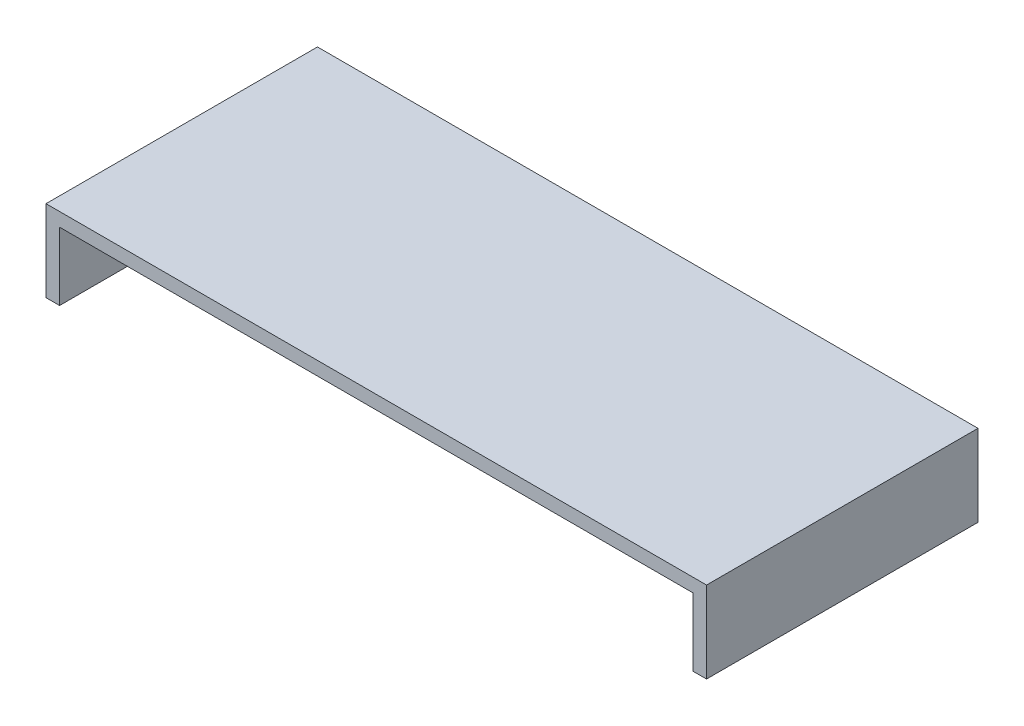
ISO-10303-21;
HEADER;
FILE_DESCRIPTION(('STEP AP214'),'2;1');
FILE_NAME('part.step','',(''),(''),'','','');
FILE_SCHEMA(('AUTOMOTIVE_DESIGN { 1 0 10303 214 1 1 1 1 }'));
ENDSEC;
DATA;
#1=APPLICATION_CONTEXT('core data for automotive mechanical design processes');
#2=APPLICATION_PROTOCOL_DEFINITION('international standard','automotive_design',2000,#1);
#3=PRODUCT_CONTEXT('',#1,'mechanical');
#4=PRODUCT('Part','Part','',(#3));
#5=PRODUCT_RELATED_PRODUCT_CATEGORY('part','',(#4));
#6=PRODUCT_DEFINITION_FORMATION('','',#4);
#7=PRODUCT_DEFINITION_CONTEXT('part definition',#1,'design');
#8=PRODUCT_DEFINITION('design','',#6,#7);
#9=PRODUCT_DEFINITION_SHAPE('','',#8);
#10=(LENGTH_UNIT() NAMED_UNIT(*) SI_UNIT(.MILLI.,.METRE.));
#11=(NAMED_UNIT(*) PLANE_ANGLE_UNIT() SI_UNIT($,.RADIAN.));
#12=(NAMED_UNIT(*) SI_UNIT($,.STERADIAN.) SOLID_ANGLE_UNIT());
#13=UNCERTAINTY_MEASURE_WITH_UNIT(LENGTH_MEASURE(1.E-05),#10,'distance_accuracy_value','');
#14=(GEOMETRIC_REPRESENTATION_CONTEXT(3) GLOBAL_UNCERTAINTY_ASSIGNED_CONTEXT((#13)) GLOBAL_UNIT_ASSIGNED_CONTEXT((#10,
#11,#12)) REPRESENTATION_CONTEXT('',''));
#15=CARTESIAN_POINT('',(0.,0.,0.));
#16=DIRECTION('',(0.,0.,1.));
#17=DIRECTION('',(1.,0.,0.));
#18=AXIS2_PLACEMENT_3D('',#15,#16,#17);
#19=CARTESIAN_POINT('',(0.,0.,0.));
#20=DIRECTION('',(0.,-1.,0.));
#21=DIRECTION('',(0.,0.,-1.));
#22=AXIS2_PLACEMENT_3D('',#19,#20,#21);
#23=PLANE('',#22);
#24=DIRECTION('',(0.,0.,-1.));
#25=VECTOR('',#24,1.);
#26=CARTESIAN_POINT('',(0.003,0.,0.));
#27=LINE('',#26,#25);
#28=CARTESIAN_POINT('',(0.003,0.,0.));
#29=VERTEX_POINT('',#28);
#30=CARTESIAN_POINT('',(0.00300000000000001,0.,-0.06));
#31=VERTEX_POINT('',#30);
#32=EDGE_CURVE('E113',#29,#31,#27,.T.);
#33=ORIENTED_EDGE('',*,*,#32,.F.);
#34=DIRECTION('',(1.,0.,0.));
#35=VECTOR('',#34,1.);
#36=CARTESIAN_POINT('',(0.,0.,0.));
#37=LINE('',#36,#35);
#38=CARTESIAN_POINT('',(0.,0.,0.));
#39=VERTEX_POINT('',#38);
#40=EDGE_CURVE('E153',#39,#29,#37,.T.);
#41=ORIENTED_EDGE('',*,*,#40,.F.);
#42=DIRECTION('',(0.,0.,1.));
#43=VECTOR('',#42,1.);
#44=CARTESIAN_POINT('',(0.,0.,0.));
#45=LINE('',#44,#43);
#46=CARTESIAN_POINT('',(0.,0.,-0.06));
#47=VERTEX_POINT('',#46);
#48=EDGE_CURVE('E137',#47,#39,#45,.T.);
#49=ORIENTED_EDGE('',*,*,#48,.F.);
#50=DIRECTION('',(-1.,0.,0.));
#51=VECTOR('',#50,1.);
#52=CARTESIAN_POINT('',(0.,0.,-0.06));
#53=LINE('',#52,#51);
#54=EDGE_CURVE('E80',#31,#47,#53,.T.);
#55=ORIENTED_EDGE('',*,*,#54,.F.);
#56=EDGE_LOOP('',(#33,#41,#49,#55));
#57=FACE_BOUND('',#56,.T.);
#58=ADVANCED_FACE('F35',(#57),#23,.T.);
#59=CARTESIAN_POINT('',(0.,0.018,0.));
#60=DIRECTION('',(1.,0.,0.));
#61=DIRECTION('',(0.,0.,-1.));
#62=AXIS2_PLACEMENT_3D('',#59,#60,#61);
#63=PLANE('',#62);
#64=ORIENTED_EDGE('',*,*,#48,.T.);
#65=DIRECTION('',(0.,-1.,0.));
#66=VECTOR('',#65,1.);
#67=CARTESIAN_POINT('',(0.,0.018,0.));
#68=LINE('',#67,#66);
#69=CARTESIAN_POINT('',(0.,0.018,0.));
#70=VERTEX_POINT('',#69);
#71=EDGE_CURVE('E11',#70,#39,#68,.T.);
#72=ORIENTED_EDGE('',*,*,#71,.F.);
#73=DIRECTION('',(0.,0.,1.));
#74=VECTOR('',#73,1.);
#75=CARTESIAN_POINT('',(0.,0.018,0.));
#76=LINE('',#75,#74);
#77=CARTESIAN_POINT('',(0.,0.018,-0.06));
#78=VERTEX_POINT('',#77);
#79=EDGE_CURVE('E142',#78,#70,#76,.T.);
#80=ORIENTED_EDGE('',*,*,#79,.F.);
#81=DIRECTION('',(0.,-1.,0.));
#82=VECTOR('',#81,1.);
#83=CARTESIAN_POINT('',(0.,0.018,-0.06));
#84=LINE('',#83,#82);
#85=EDGE_CURVE('E149',#78,#47,#84,.T.);
#86=ORIENTED_EDGE('',*,*,#85,.T.);
#87=EDGE_LOOP('',(#64,#72,#80,#86));
#88=FACE_BOUND('',#87,.T.);
#89=ADVANCED_FACE('F37',(#88),#63,.F.);
#90=CARTESIAN_POINT('',(0.,0.018,0.));
#91=DIRECTION('',(0.,0.,-1.));
#92=DIRECTION('',(-1.,0.,0.));
#93=AXIS2_PLACEMENT_3D('',#90,#91,#92);
#94=PLANE('',#93);
#95=ORIENTED_EDGE('',*,*,#40,.T.);
#96=DIRECTION('',(0.,-1.,0.));
#97=VECTOR('',#96,1.);
#98=CARTESIAN_POINT('',(0.003,0.015,0.));
#99=LINE('',#98,#97);
#100=CARTESIAN_POINT('',(0.003,0.015,0.));
#101=VERTEX_POINT('',#100);
#102=EDGE_CURVE('E135',#101,#29,#99,.T.);
#103=ORIENTED_EDGE('',*,*,#102,.F.);
#104=DIRECTION('',(-1.,0.,0.));
#105=VECTOR('',#104,1.);
#106=CARTESIAN_POINT('',(0.003,0.015,0.));
#107=LINE('',#106,#105);
#108=CARTESIAN_POINT('',(0.143,0.015,0.));
#109=VERTEX_POINT('',#108);
#110=EDGE_CURVE('E115',#109,#101,#107,.T.);
#111=ORIENTED_EDGE('',*,*,#110,.F.);
#112=DIRECTION('',(0.,-1.,0.));
#113=VECTOR('',#112,1.);
#114=CARTESIAN_POINT('',(0.143,0.015,0.));
#115=LINE('',#114,#113);
#116=CARTESIAN_POINT('',(0.143,0.,0.));
#117=VERTEX_POINT('',#116);
#118=EDGE_CURVE('E138',#109,#117,#115,.T.);
#119=ORIENTED_EDGE('',*,*,#118,.T.);
#120=CARTESIAN_POINT('',(0.146,0.,0.));
#121=VERTEX_POINT('',#120);
#122=EDGE_CURVE('E152',#117,#121,#37,.T.);
#123=ORIENTED_EDGE('',*,*,#122,.T.);
#124=DIRECTION('',(0.,-1.,0.));
#125=VECTOR('',#124,1.);
#126=CARTESIAN_POINT('',(0.146,0.018,0.));
#127=LINE('',#126,#125);
#128=CARTESIAN_POINT('',(0.146,0.018,0.));
#129=VERTEX_POINT('',#128);
#130=EDGE_CURVE('E43',#129,#121,#127,.T.);
#131=ORIENTED_EDGE('',*,*,#130,.F.);
#132=DIRECTION('',(1.,0.,0.));
#133=VECTOR('',#132,1.);
#134=CARTESIAN_POINT('',(0.,0.018,0.));
#135=LINE('',#134,#133);
#136=EDGE_CURVE('E87',#70,#129,#135,.T.);
#137=ORIENTED_EDGE('',*,*,#136,.F.);
#138=ORIENTED_EDGE('',*,*,#71,.T.);
#139=EDGE_LOOP('',(#95,#103,#111,#119,#123,#131,#137,#138));
#140=FACE_BOUND('',#139,.T.);
#141=ADVANCED_FACE('F191',(#140),#94,.F.);
#142=CARTESIAN_POINT('',(0.146,0.018,0.));
#143=DIRECTION('',(-1.,0.,0.));
#144=DIRECTION('',(0.,0.,1.));
#145=AXIS2_PLACEMENT_3D('',#142,#143,#144);
#146=PLANE('',#145);
#147=DIRECTION('',(0.,0.,-1.));
#148=VECTOR('',#147,1.);
#149=CARTESIAN_POINT('',(0.146,0.,0.));
#150=LINE('',#149,#148);
#151=CARTESIAN_POINT('',(0.146,0.,-0.06));
#152=VERTEX_POINT('',#151);
#153=EDGE_CURVE('E156',#121,#152,#150,.T.);
#154=ORIENTED_EDGE('',*,*,#153,.T.);
#155=DIRECTION('',(0.,-1.,0.));
#156=VECTOR('',#155,1.);
#157=CARTESIAN_POINT('',(0.146,0.018,-0.06));
#158=LINE('',#157,#156);
#159=CARTESIAN_POINT('',(0.146,0.018,-0.06));
#160=VERTEX_POINT('',#159);
#161=EDGE_CURVE('E160',#160,#152,#158,.T.);
#162=ORIENTED_EDGE('',*,*,#161,.F.);
#163=DIRECTION('',(0.,0.,-1.));
#164=VECTOR('',#163,1.);
#165=CARTESIAN_POINT('',(0.146,0.018,0.));
#166=LINE('',#165,#164);
#167=EDGE_CURVE('E146',#129,#160,#166,.T.);
#168=ORIENTED_EDGE('',*,*,#167,.F.);
#169=ORIENTED_EDGE('',*,*,#130,.T.);
#170=EDGE_LOOP('',(#154,#162,#168,#169));
#171=FACE_BOUND('',#170,.T.);
#172=ADVANCED_FACE('F166',(#171),#146,.F.);
#173=CARTESIAN_POINT('',(0.,0.018,-0.06));
#174=DIRECTION('',(0.,0.,1.));
#175=DIRECTION('',(1.,0.,0.));
#176=AXIS2_PLACEMENT_3D('',#173,#174,#175);
#177=PLANE('',#176);
#178=DIRECTION('',(1.,0.,0.));
#179=VECTOR('',#178,1.);
#180=CARTESIAN_POINT('',(0.00300000000000001,0.015,-0.06));
#181=LINE('',#180,#179);
#182=CARTESIAN_POINT('',(0.00300000000000001,0.015,-0.06));
#183=VERTEX_POINT('',#182);
#184=CARTESIAN_POINT('',(0.143,0.015,-0.06));
#185=VERTEX_POINT('',#184);
#186=EDGE_CURVE('E121',#183,#185,#181,.T.);
#187=ORIENTED_EDGE('',*,*,#186,.F.);
#188=DIRECTION('',(0.,-1.,0.));
#189=VECTOR('',#188,1.);
#190=CARTESIAN_POINT('',(0.00300000000000001,0.015,-0.06));
#191=LINE('',#190,#189);
#192=EDGE_CURVE('E107',#183,#31,#191,.T.);
#193=ORIENTED_EDGE('',*,*,#192,.T.);
#194=ORIENTED_EDGE('',*,*,#54,.T.);
#195=ORIENTED_EDGE('',*,*,#85,.F.);
#196=DIRECTION('',(-1.,0.,0.));
#197=VECTOR('',#196,1.);
#198=CARTESIAN_POINT('',(0.,0.018,-0.06));
#199=LINE('',#198,#197);
#200=EDGE_CURVE('E59',#160,#78,#199,.T.);
#201=ORIENTED_EDGE('',*,*,#200,.F.);
#202=ORIENTED_EDGE('',*,*,#161,.T.);
#203=CARTESIAN_POINT('',(0.143,0.,-0.06));
#204=VERTEX_POINT('',#203);
#205=EDGE_CURVE('E144',#152,#204,#53,.T.);
#206=ORIENTED_EDGE('',*,*,#205,.T.);
#207=DIRECTION('',(0.,-1.,0.));
#208=VECTOR('',#207,1.);
#209=CARTESIAN_POINT('',(0.143,0.015,-0.06));
#210=LINE('',#209,#208);
#211=EDGE_CURVE('E50',#185,#204,#210,.T.);
#212=ORIENTED_EDGE('',*,*,#211,.F.);
#213=EDGE_LOOP('',(#187,#193,#194,#195,#201,#202,#206,#212));
#214=FACE_BOUND('',#213,.T.);
#215=ADVANCED_FACE('F126',(#214),#177,.F.);
#216=CARTESIAN_POINT('',(0.,0.018,0.));
#217=DIRECTION('',(0.,-1.,0.));
#218=DIRECTION('',(0.,0.,-1.));
#219=AXIS2_PLACEMENT_3D('',#216,#217,#218);
#220=PLANE('',#219);
#221=ORIENTED_EDGE('',*,*,#79,.T.);
#222=ORIENTED_EDGE('',*,*,#136,.T.);
#223=ORIENTED_EDGE('',*,*,#167,.T.);
#224=ORIENTED_EDGE('',*,*,#200,.T.);
#225=EDGE_LOOP('',(#221,#222,#223,#224));
#226=FACE_BOUND('',#225,.T.);
#227=ADVANCED_FACE('F176',(#226),#220,.F.);
#228=DIRECTION('',(0.,0.,1.));
#229=VECTOR('',#228,1.);
#230=CARTESIAN_POINT('',(0.143,0.,0.));
#231=LINE('',#230,#229);
#232=EDGE_CURVE('E124',#204,#117,#231,.T.);
#233=ORIENTED_EDGE('',*,*,#232,.F.);
#234=ORIENTED_EDGE('',*,*,#205,.F.);
#235=ORIENTED_EDGE('',*,*,#153,.F.);
#236=ORIENTED_EDGE('',*,*,#122,.F.);
#237=EDGE_LOOP('',(#233,#234,#235,#236));
#238=FACE_BOUND('',#237,.T.);
#239=ADVANCED_FACE('F171',(#238),#23,.T.);
#240=CARTESIAN_POINT('',(0.003,0.015,0.));
#241=DIRECTION('',(-1.,0.,0.));
#242=DIRECTION('',(0.,0.,1.));
#243=AXIS2_PLACEMENT_3D('',#240,#241,#242);
#244=PLANE('',#243);
#245=ORIENTED_EDGE('',*,*,#32,.T.);
#246=ORIENTED_EDGE('',*,*,#192,.F.);
#247=DIRECTION('',(0.,0.,-1.));
#248=VECTOR('',#247,1.);
#249=CARTESIAN_POINT('',(0.003,0.015,0.));
#250=LINE('',#249,#248);
#251=EDGE_CURVE('E110',#101,#183,#250,.T.);
#252=ORIENTED_EDGE('',*,*,#251,.F.);
#253=ORIENTED_EDGE('',*,*,#102,.T.);
#254=EDGE_LOOP('',(#245,#246,#252,#253));
#255=FACE_BOUND('',#254,.T.);
#256=ADVANCED_FACE('F109',(#255),#244,.F.);
#257=CARTESIAN_POINT('',(0.143,0.015,0.));
#258=DIRECTION('',(1.,0.,0.));
#259=DIRECTION('',(0.,0.,-1.));
#260=AXIS2_PLACEMENT_3D('',#257,#258,#259);
#261=PLANE('',#260);
#262=ORIENTED_EDGE('',*,*,#232,.T.);
#263=ORIENTED_EDGE('',*,*,#118,.F.);
#264=DIRECTION('',(0.,0.,1.));
#265=VECTOR('',#264,1.);
#266=CARTESIAN_POINT('',(0.143,0.015,0.));
#267=LINE('',#266,#265);
#268=EDGE_CURVE('E128',#185,#109,#267,.T.);
#269=ORIENTED_EDGE('',*,*,#268,.F.);
#270=ORIENTED_EDGE('',*,*,#211,.T.);
#271=EDGE_LOOP('',(#262,#263,#269,#270));
#272=FACE_BOUND('',#271,.T.);
#273=ADVANCED_FACE('F197',(#272),#261,.F.);
#274=CARTESIAN_POINT('',(0.,0.015,0.));
#275=DIRECTION('',(0.,-1.,0.));
#276=DIRECTION('',(0.,0.,-1.));
#277=AXIS2_PLACEMENT_3D('',#274,#275,#276);
#278=PLANE('',#277);
#279=ORIENTED_EDGE('',*,*,#251,.T.);
#280=ORIENTED_EDGE('',*,*,#186,.T.);
#281=ORIENTED_EDGE('',*,*,#268,.T.);
#282=ORIENTED_EDGE('',*,*,#110,.T.);
#283=EDGE_LOOP('',(#279,#280,#281,#282));
#284=FACE_BOUND('',#283,.T.);
#285=ADVANCED_FACE('F119',(#284),#278,.T.);
#286=CLOSED_SHELL('',(#58,#89,#141,#172,#215,#227,#239,#256,#273,#285));
#287=MANIFOLD_SOLID_BREP('B2',#286);
#288=ADVANCED_BREP_SHAPE_REPRESENTATION('',(#18,#287),#14);
#289=SHAPE_DEFINITION_REPRESENTATION(#9,#288);
ENDSEC;
END-ISO-10303-21;
